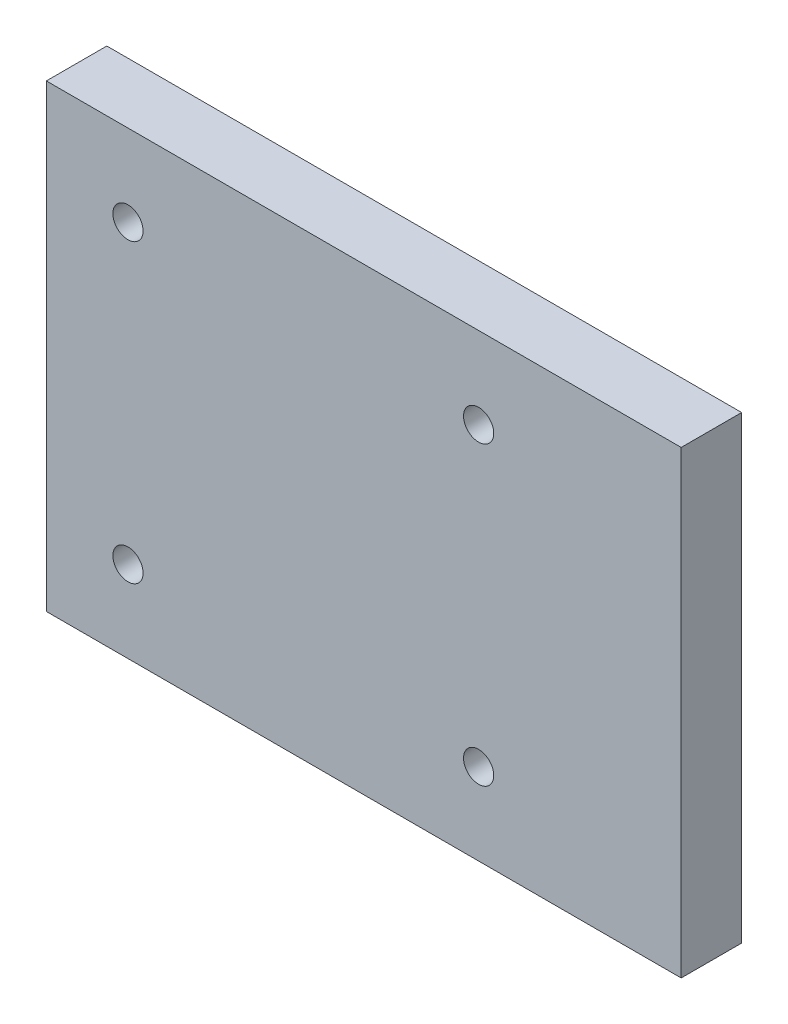
ISO-10303-21;
HEADER;
FILE_DESCRIPTION(('STEP AP214'),'2;1');
FILE_NAME('part.step','',(''),(''),'','','');
FILE_SCHEMA(('AUTOMOTIVE_DESIGN { 1 0 10303 214 1 1 1 1 }'));
ENDSEC;
DATA;
#1=APPLICATION_CONTEXT('core data for automotive mechanical design processes');
#2=APPLICATION_PROTOCOL_DEFINITION('international standard','automotive_design',2000,#1);
#3=PRODUCT_CONTEXT('',#1,'mechanical');
#4=PRODUCT('Part','Part','',(#3));
#5=PRODUCT_RELATED_PRODUCT_CATEGORY('part','',(#4));
#6=PRODUCT_DEFINITION_FORMATION('','',#4);
#7=PRODUCT_DEFINITION_CONTEXT('part definition',#1,'design');
#8=PRODUCT_DEFINITION('design','',#6,#7);
#9=PRODUCT_DEFINITION_SHAPE('','',#8);
#10=(LENGTH_UNIT() NAMED_UNIT(*) SI_UNIT(.MILLI.,.METRE.));
#11=(NAMED_UNIT(*) PLANE_ANGLE_UNIT() SI_UNIT($,.RADIAN.));
#12=(NAMED_UNIT(*) SI_UNIT($,.STERADIAN.) SOLID_ANGLE_UNIT());
#13=UNCERTAINTY_MEASURE_WITH_UNIT(LENGTH_MEASURE(1.E-05),#10,'distance_accuracy_value','');
#14=(GEOMETRIC_REPRESENTATION_CONTEXT(3) GLOBAL_UNCERTAINTY_ASSIGNED_CONTEXT((#13)) GLOBAL_UNIT_ASSIGNED_CONTEXT((#10,
#11,#12)) REPRESENTATION_CONTEXT('',''));
#15=CARTESIAN_POINT('',(0.,0.,0.));
#16=DIRECTION('',(0.,0.,1.));
#17=DIRECTION('',(1.,0.,0.));
#18=AXIS2_PLACEMENT_3D('',#15,#16,#17);
#19=CARTESIAN_POINT('',(52.5,0.,10.));
#20=DIRECTION('',(1.,0.,0.));
#21=DIRECTION('',(0.,0.,-1.));
#22=AXIS2_PLACEMENT_3D('',#19,#20,#21);
#23=PLANE('',#22);
#24=DIRECTION('',(0.,-1.,0.));
#25=VECTOR('',#24,1.);
#26=CARTESIAN_POINT('',(52.5,0.,0.));
#27=LINE('',#26,#25);
#28=CARTESIAN_POINT('',(52.5,38.,0.));
#29=VERTEX_POINT('',#28);
#30=CARTESIAN_POINT('',(52.5,-38.,0.));
#31=VERTEX_POINT('',#30);
#32=EDGE_CURVE('E124',#29,#31,#27,.T.);
#33=ORIENTED_EDGE('',*,*,#32,.F.);
#34=DIRECTION('',(0.,0.,-1.));
#35=VECTOR('',#34,1.);
#36=CARTESIAN_POINT('',(52.5,38.,10.));
#37=LINE('',#36,#35);
#38=CARTESIAN_POINT('',(52.5,38.,10.));
#39=VERTEX_POINT('',#38);
#40=EDGE_CURVE('E11',#39,#29,#37,.T.);
#41=ORIENTED_EDGE('',*,*,#40,.F.);
#42=DIRECTION('',(0.,-1.,0.));
#43=VECTOR('',#42,1.);
#44=CARTESIAN_POINT('',(52.5,0.,10.));
#45=LINE('',#44,#43);
#46=CARTESIAN_POINT('',(52.5,-38.,10.));
#47=VERTEX_POINT('',#46);
#48=EDGE_CURVE('E89',#39,#47,#45,.T.);
#49=ORIENTED_EDGE('',*,*,#48,.T.);
#50=DIRECTION('',(0.,0.,-1.));
#51=VECTOR('',#50,1.);
#52=CARTESIAN_POINT('',(52.5,-38.,10.));
#53=LINE('',#52,#51);
#54=EDGE_CURVE('E56',#47,#31,#53,.T.);
#55=ORIENTED_EDGE('',*,*,#54,.T.);
#56=EDGE_LOOP('',(#33,#41,#49,#55));
#57=FACE_BOUND('',#56,.T.);
#58=ADVANCED_FACE('F39',(#57),#23,.T.);
#59=CARTESIAN_POINT('',(0.,38.,10.));
#60=DIRECTION('',(0.,-1.,0.));
#61=DIRECTION('',(0.,0.,-1.));
#62=AXIS2_PLACEMENT_3D('',#59,#60,#61);
#63=PLANE('',#62);
#64=DIRECTION('',(-1.,0.,0.));
#65=VECTOR('',#64,1.);
#66=CARTESIAN_POINT('',(0.,38.,0.));
#67=LINE('',#66,#65);
#68=CARTESIAN_POINT('',(-52.5,38.,0.));
#69=VERTEX_POINT('',#68);
#70=EDGE_CURVE('E96',#29,#69,#67,.T.);
#71=ORIENTED_EDGE('',*,*,#70,.T.);
#72=DIRECTION('',(0.,0.,-1.));
#73=VECTOR('',#72,1.);
#74=CARTESIAN_POINT('',(-52.5,38.,10.));
#75=LINE('',#74,#73);
#76=CARTESIAN_POINT('',(-52.5,38.,10.));
#77=VERTEX_POINT('',#76);
#78=EDGE_CURVE('E48',#77,#69,#75,.T.);
#79=ORIENTED_EDGE('',*,*,#78,.F.);
#80=DIRECTION('',(-1.,0.,0.));
#81=VECTOR('',#80,1.);
#82=CARTESIAN_POINT('',(0.,38.,10.));
#83=LINE('',#82,#81);
#84=EDGE_CURVE('E82',#39,#77,#83,.T.);
#85=ORIENTED_EDGE('',*,*,#84,.F.);
#86=ORIENTED_EDGE('',*,*,#40,.T.);
#87=EDGE_LOOP('',(#71,#79,#85,#86));
#88=FACE_BOUND('',#87,.T.);
#89=ADVANCED_FACE('F94',(#88),#63,.F.);
#90=CARTESIAN_POINT('',(-52.5,0.,10.));
#91=DIRECTION('',(1.,0.,0.));
#92=DIRECTION('',(0.,0.,-1.));
#93=AXIS2_PLACEMENT_3D('',#90,#91,#92);
#94=PLANE('',#93);
#95=DIRECTION('',(0.,-1.,0.));
#96=VECTOR('',#95,1.);
#97=CARTESIAN_POINT('',(-52.5,0.,0.));
#98=LINE('',#97,#96);
#99=CARTESIAN_POINT('',(-52.5,-38.,0.));
#100=VERTEX_POINT('',#99);
#101=EDGE_CURVE('E129',#69,#100,#98,.T.);
#102=ORIENTED_EDGE('',*,*,#101,.T.);
#103=DIRECTION('',(0.,0.,-1.));
#104=VECTOR('',#103,1.);
#105=CARTESIAN_POINT('',(-52.5,-38.,10.));
#106=LINE('',#105,#104);
#107=CARTESIAN_POINT('',(-52.5,-38.,10.));
#108=VERTEX_POINT('',#107);
#109=EDGE_CURVE('E70',#108,#100,#106,.T.);
#110=ORIENTED_EDGE('',*,*,#109,.F.);
#111=DIRECTION('',(0.,-1.,0.));
#112=VECTOR('',#111,1.);
#113=CARTESIAN_POINT('',(-52.5,0.,10.));
#114=LINE('',#113,#112);
#115=EDGE_CURVE('E88',#77,#108,#114,.T.);
#116=ORIENTED_EDGE('',*,*,#115,.F.);
#117=ORIENTED_EDGE('',*,*,#78,.T.);
#118=EDGE_LOOP('',(#102,#110,#116,#117));
#119=FACE_BOUND('',#118,.T.);
#120=ADVANCED_FACE('F100',(#119),#94,.F.);
#121=CARTESIAN_POINT('',(-39.,24.5,10.));
#122=DIRECTION('',(0.,0.,-1.));
#123=DIRECTION('',(-1.,0.,0.));
#124=AXIS2_PLACEMENT_3D('',#121,#122,#123);
#125=CYLINDRICAL_SURFACE('',#124,2.5);
#126=CARTESIAN_POINT('',(-39.,24.5,10.));
#127=DIRECTION('',(0.,0.,1.));
#128=DIRECTION('',(1.,0.,0.));
#129=AXIS2_PLACEMENT_3D('',#126,#127,#128);
#130=CIRCLE('',#129,2.5);
#131=CARTESIAN_POINT('',(-36.5,24.5,10.));
#132=VERTEX_POINT('',#131);
#133=EDGE_CURVE('E116',#132,#132,#130,.T.);
#134=ORIENTED_EDGE('',*,*,#133,.T.);
#135=EDGE_LOOP('',(#134));
#136=FACE_BOUND('',#135,.T.);
#137=CARTESIAN_POINT('',(-39.,24.5,0.));
#138=DIRECTION('',(0.,0.,1.));
#139=DIRECTION('',(1.,0.,0.));
#140=AXIS2_PLACEMENT_3D('',#137,#138,#139);
#141=CIRCLE('',#140,2.5);
#142=CARTESIAN_POINT('',(-36.5,24.5,0.));
#143=VERTEX_POINT('',#142);
#144=EDGE_CURVE('E144',#143,#143,#141,.T.);
#145=ORIENTED_EDGE('',*,*,#144,.F.);
#146=EDGE_LOOP('',(#145));
#147=FACE_BOUND('',#146,.T.);
#148=ADVANCED_FACE('F180',(#136,#147),#125,.F.);
#149=CARTESIAN_POINT('',(19.,-24.5,10.));
#150=DIRECTION('',(0.,0.,-1.));
#151=DIRECTION('',(-1.,0.,0.));
#152=AXIS2_PLACEMENT_3D('',#149,#150,#151);
#153=CYLINDRICAL_SURFACE('',#152,2.5);
#154=CARTESIAN_POINT('',(19.,-24.5,10.));
#155=DIRECTION('',(0.,0.,1.));
#156=DIRECTION('',(1.,0.,0.));
#157=AXIS2_PLACEMENT_3D('',#154,#155,#156);
#158=CIRCLE('',#157,2.5);
#159=CARTESIAN_POINT('',(21.5,-24.5,10.));
#160=VERTEX_POINT('',#159);
#161=EDGE_CURVE('E112',#160,#160,#158,.T.);
#162=ORIENTED_EDGE('',*,*,#161,.T.);
#163=EDGE_LOOP('',(#162));
#164=FACE_BOUND('',#163,.T.);
#165=CARTESIAN_POINT('',(19.,-24.5,0.));
#166=DIRECTION('',(0.,0.,1.));
#167=DIRECTION('',(1.,0.,0.));
#168=AXIS2_PLACEMENT_3D('',#165,#166,#167);
#169=CIRCLE('',#168,2.5);
#170=CARTESIAN_POINT('',(21.5,-24.5,0.));
#171=VERTEX_POINT('',#170);
#172=EDGE_CURVE('E140',#171,#171,#169,.T.);
#173=ORIENTED_EDGE('',*,*,#172,.F.);
#174=EDGE_LOOP('',(#173));
#175=FACE_BOUND('',#174,.T.);
#176=ADVANCED_FACE('F169',(#164,#175),#153,.F.);
#177=CARTESIAN_POINT('',(-39.,-24.5,10.));
#178=DIRECTION('',(0.,0.,-1.));
#179=DIRECTION('',(-1.,0.,0.));
#180=AXIS2_PLACEMENT_3D('',#177,#178,#179);
#181=CYLINDRICAL_SURFACE('',#180,2.5);
#182=CARTESIAN_POINT('',(-39.,-24.5,10.));
#183=DIRECTION('',(0.,0.,1.));
#184=DIRECTION('',(1.,0.,0.));
#185=AXIS2_PLACEMENT_3D('',#182,#183,#184);
#186=CIRCLE('',#185,2.5);
#187=CARTESIAN_POINT('',(-36.5,-24.5,10.));
#188=VERTEX_POINT('',#187);
#189=EDGE_CURVE('E105',#188,#188,#186,.T.);
#190=ORIENTED_EDGE('',*,*,#189,.T.);
#191=EDGE_LOOP('',(#190));
#192=FACE_BOUND('',#191,.T.);
#193=CARTESIAN_POINT('',(-39.,-24.5,0.));
#194=DIRECTION('',(0.,0.,1.));
#195=DIRECTION('',(1.,0.,0.));
#196=AXIS2_PLACEMENT_3D('',#193,#194,#195);
#197=CIRCLE('',#196,2.5);
#198=CARTESIAN_POINT('',(-36.5,-24.5,0.));
#199=VERTEX_POINT('',#198);
#200=EDGE_CURVE('E136',#199,#199,#197,.T.);
#201=ORIENTED_EDGE('',*,*,#200,.F.);
#202=EDGE_LOOP('',(#201));
#203=FACE_BOUND('',#202,.T.);
#204=ADVANCED_FACE('F161',(#192,#203),#181,.F.);
#205=CARTESIAN_POINT('',(0.,-38.,10.));
#206=DIRECTION('',(0.,-1.,0.));
#207=DIRECTION('',(0.,0.,-1.));
#208=AXIS2_PLACEMENT_3D('',#205,#206,#207);
#209=PLANE('',#208);
#210=DIRECTION('',(-1.,0.,0.));
#211=VECTOR('',#210,1.);
#212=CARTESIAN_POINT('',(0.,-38.,0.));
#213=LINE('',#212,#211);
#214=EDGE_CURVE('E132',#31,#100,#213,.T.);
#215=ORIENTED_EDGE('',*,*,#214,.F.);
#216=ORIENTED_EDGE('',*,*,#54,.F.);
#217=DIRECTION('',(-1.,0.,0.));
#218=VECTOR('',#217,1.);
#219=CARTESIAN_POINT('',(0.,-38.,10.));
#220=LINE('',#219,#218);
#221=EDGE_CURVE('E102',#47,#108,#220,.T.);
#222=ORIENTED_EDGE('',*,*,#221,.T.);
#223=ORIENTED_EDGE('',*,*,#109,.T.);
#224=EDGE_LOOP('',(#215,#216,#222,#223));
#225=FACE_BOUND('',#224,.T.);
#226=ADVANCED_FACE('F158',(#225),#209,.T.);
#227=CARTESIAN_POINT('',(19.,24.5,10.));
#228=DIRECTION('',(0.,0.,-1.));
#229=DIRECTION('',(-1.,0.,0.));
#230=AXIS2_PLACEMENT_3D('',#227,#228,#229);
#231=CYLINDRICAL_SURFACE('',#230,2.5);
#232=CARTESIAN_POINT('',(19.,24.5,10.));
#233=DIRECTION('',(0.,0.,1.));
#234=DIRECTION('',(1.,0.,0.));
#235=AXIS2_PLACEMENT_3D('',#232,#233,#234);
#236=CIRCLE('',#235,2.5);
#237=CARTESIAN_POINT('',(21.5,24.5,10.));
#238=VERTEX_POINT('',#237);
#239=EDGE_CURVE('E120',#238,#238,#236,.T.);
#240=ORIENTED_EDGE('',*,*,#239,.T.);
#241=EDGE_LOOP('',(#240));
#242=FACE_BOUND('',#241,.T.);
#243=CARTESIAN_POINT('',(19.,24.5,0.));
#244=DIRECTION('',(0.,0.,1.));
#245=DIRECTION('',(1.,0.,0.));
#246=AXIS2_PLACEMENT_3D('',#243,#244,#245);
#247=CIRCLE('',#246,2.5);
#248=CARTESIAN_POINT('',(21.5,24.5,0.));
#249=VERTEX_POINT('',#248);
#250=EDGE_CURVE('E148',#249,#249,#247,.T.);
#251=ORIENTED_EDGE('',*,*,#250,.F.);
#252=EDGE_LOOP('',(#251));
#253=FACE_BOUND('',#252,.T.);
#254=ADVANCED_FACE('F160',(#242,#253),#231,.F.);
#255=CARTESIAN_POINT('',(0.,0.,10.));
#256=DIRECTION('',(0.,0.,1.));
#257=DIRECTION('',(1.,0.,0.));
#258=AXIS2_PLACEMENT_3D('',#255,#256,#257);
#259=PLANE('',#258);
#260=ORIENTED_EDGE('',*,*,#48,.F.);
#261=ORIENTED_EDGE('',*,*,#84,.T.);
#262=ORIENTED_EDGE('',*,*,#115,.T.);
#263=ORIENTED_EDGE('',*,*,#221,.F.);
#264=EDGE_LOOP('',(#260,#261,#262,#263));
#265=FACE_BOUND('',#264,.T.);
#266=ORIENTED_EDGE('',*,*,#189,.F.);
#267=EDGE_LOOP('',(#266));
#268=FACE_BOUND('',#267,.T.);
#269=ORIENTED_EDGE('',*,*,#161,.F.);
#270=EDGE_LOOP('',(#269));
#271=FACE_BOUND('',#270,.T.);
#272=ORIENTED_EDGE('',*,*,#133,.F.);
#273=EDGE_LOOP('',(#272));
#274=FACE_BOUND('',#273,.T.);
#275=ORIENTED_EDGE('',*,*,#239,.F.);
#276=EDGE_LOOP('',(#275));
#277=FACE_BOUND('',#276,.T.);
#278=ADVANCED_FACE('F84',(#265,#268,#271,#274,#277),#259,.T.);
#279=CARTESIAN_POINT('',(0.,0.,0.));
#280=DIRECTION('',(0.,0.,1.));
#281=DIRECTION('',(1.,0.,0.));
#282=AXIS2_PLACEMENT_3D('',#279,#280,#281);
#283=PLANE('',#282);
#284=ORIENTED_EDGE('',*,*,#32,.T.);
#285=ORIENTED_EDGE('',*,*,#214,.T.);
#286=ORIENTED_EDGE('',*,*,#101,.F.);
#287=ORIENTED_EDGE('',*,*,#70,.F.);
#288=EDGE_LOOP('',(#284,#285,#286,#287));
#289=FACE_BOUND('',#288,.T.);
#290=ORIENTED_EDGE('',*,*,#200,.T.);
#291=EDGE_LOOP('',(#290));
#292=FACE_BOUND('',#291,.T.);
#293=ORIENTED_EDGE('',*,*,#172,.T.);
#294=EDGE_LOOP('',(#293));
#295=FACE_BOUND('',#294,.T.);
#296=ORIENTED_EDGE('',*,*,#144,.T.);
#297=EDGE_LOOP('',(#296));
#298=FACE_BOUND('',#297,.T.);
#299=ORIENTED_EDGE('',*,*,#250,.T.);
#300=EDGE_LOOP('',(#299));
#301=FACE_BOUND('',#300,.T.);
#302=ADVANCED_FACE('F193',(#289,#292,#295,#298,#301),#283,.F.);
#303=CLOSED_SHELL('',(#58,#89,#120,#148,#176,#204,#226,#254,#278,#302));
#304=MANIFOLD_SOLID_BREP('B2',#303);
#305=ADVANCED_BREP_SHAPE_REPRESENTATION('',(#18,#304),#14);
#306=SHAPE_DEFINITION_REPRESENTATION(#9,#305);
ENDSEC;
END-ISO-10303-21;
